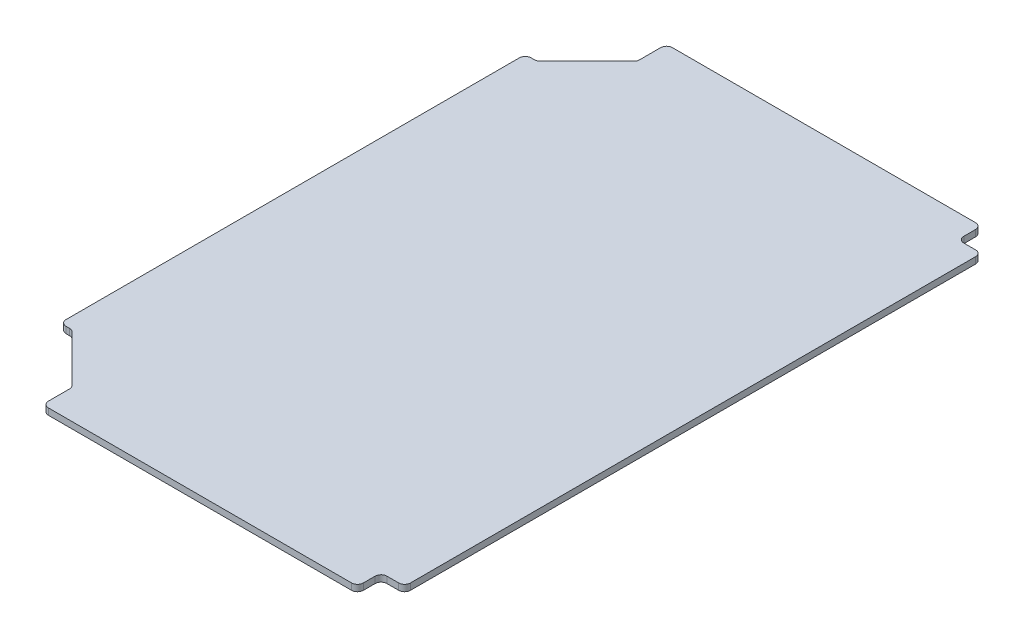
ISO-10303-21;
HEADER;
FILE_DESCRIPTION(('STEP AP214'),'2;1');
FILE_NAME('part.step','',(''),(''),'','','');
FILE_SCHEMA(('AUTOMOTIVE_DESIGN { 1 0 10303 214 1 1 1 1 }'));
ENDSEC;
DATA;
#1=APPLICATION_CONTEXT('core data for automotive mechanical design processes');
#2=APPLICATION_PROTOCOL_DEFINITION('international standard','automotive_design',2000,#1);
#3=PRODUCT_CONTEXT('',#1,'mechanical');
#4=PRODUCT('Part','Part','',(#3));
#5=PRODUCT_RELATED_PRODUCT_CATEGORY('part','',(#4));
#6=PRODUCT_DEFINITION_FORMATION('','',#4);
#7=PRODUCT_DEFINITION_CONTEXT('part definition',#1,'design');
#8=PRODUCT_DEFINITION('design','',#6,#7);
#9=PRODUCT_DEFINITION_SHAPE('','',#8);
#10=(LENGTH_UNIT() NAMED_UNIT(*) SI_UNIT(.MILLI.,.METRE.));
#11=(NAMED_UNIT(*) PLANE_ANGLE_UNIT() SI_UNIT($,.RADIAN.));
#12=(NAMED_UNIT(*) SI_UNIT($,.STERADIAN.) SOLID_ANGLE_UNIT());
#13=UNCERTAINTY_MEASURE_WITH_UNIT(LENGTH_MEASURE(1.E-05),#10,'distance_accuracy_value','');
#14=(GEOMETRIC_REPRESENTATION_CONTEXT(3) GLOBAL_UNCERTAINTY_ASSIGNED_CONTEXT((#13)) GLOBAL_UNIT_ASSIGNED_CONTEXT((#10,
#11,#12)) REPRESENTATION_CONTEXT('',''));
#15=CARTESIAN_POINT('',(0.,0.,0.));
#16=DIRECTION('',(0.,0.,1.));
#17=DIRECTION('',(1.,0.,0.));
#18=AXIS2_PLACEMENT_3D('',#15,#16,#17);
#19=CARTESIAN_POINT('',(190.5,2.778125,0.));
#20=DIRECTION('',(-1.,0.,0.));
#21=DIRECTION('',(0.,0.,1.));
#22=AXIS2_PLACEMENT_3D('',#19,#20,#21);
#23=PLANE('',#22);
#24=DIRECTION('',(0.,0.,-1.));
#25=VECTOR('',#24,1.);
#26=CARTESIAN_POINT('',(190.5,2.778125,0.));
#27=LINE('',#26,#25);
#28=CARTESIAN_POINT('',(190.5,2.778125,-30.48));
#29=VERTEX_POINT('',#28);
#30=CARTESIAN_POINT('',(190.5,2.778125,-274.32));
#31=VERTEX_POINT('',#30);
#32=EDGE_CURVE('E250',#29,#31,#27,.T.);
#33=ORIENTED_EDGE('',*,*,#32,.F.);
#34=DIRECTION('',(0.,1.,0.));
#35=VECTOR('',#34,1.);
#36=CARTESIAN_POINT('',(190.5,2.778125,-30.48));
#37=LINE('',#36,#35);
#38=CARTESIAN_POINT('',(190.5,0.,-30.48));
#39=VERTEX_POINT('',#38);
#40=EDGE_CURVE('E290',#29,#39,#37,.F.);
#41=ORIENTED_EDGE('',*,*,#40,.T.);
#42=DIRECTION('',(0.,0.,-1.));
#43=VECTOR('',#42,1.);
#44=CARTESIAN_POINT('',(190.5,0.,0.));
#45=LINE('',#44,#43);
#46=CARTESIAN_POINT('',(190.5,0.,-274.32));
#47=VERTEX_POINT('',#46);
#48=EDGE_CURVE('E241',#39,#47,#45,.T.);
#49=ORIENTED_EDGE('',*,*,#48,.T.);
#50=DIRECTION('',(0.,1.,0.));
#51=VECTOR('',#50,1.);
#52=CARTESIAN_POINT('',(190.5,2.778125,-274.32));
#53=LINE('',#52,#51);
#54=EDGE_CURVE('E287',#47,#31,#53,.T.);
#55=ORIENTED_EDGE('',*,*,#54,.T.);
#56=EDGE_LOOP('',(#33,#41,#49,#55));
#57=FACE_BOUND('',#56,.T.);
#58=ADVANCED_FACE('F34',(#57),#23,.F.);
#59=CARTESIAN_POINT('',(0.,2.778125,0.));
#60=DIRECTION('',(0.,-1.,0.));
#61=DIRECTION('',(0.,0.,-1.));
#62=AXIS2_PLACEMENT_3D('',#59,#60,#61);
#63=PLANE('',#62);
#64=DIRECTION('',(-1.,0.,0.));
#65=VECTOR('',#64,1.);
#66=CARTESIAN_POINT('',(0.,2.778125,-17.78));
#67=LINE('',#66,#65);
#68=CARTESIAN_POINT('',(177.8,2.778125,-17.78));
#69=VERTEX_POINT('',#68);
#70=CARTESIAN_POINT('',(46.99,2.778125,-17.78));
#71=VERTEX_POINT('',#70);
#72=EDGE_CURVE('E242',#69,#71,#67,.T.);
#73=ORIENTED_EDGE('',*,*,#72,.F.);
#74=CARTESIAN_POINT('',(177.8,2.778125,-20.32));
#75=DIRECTION('',(0.,-1.,0.));
#76=DIRECTION('',(0.,0.,-1.));
#77=AXIS2_PLACEMENT_3D('',#74,#75,#76);
#78=CIRCLE('',#77,2.54);
#79=CARTESIAN_POINT('',(180.34,2.778125,-20.32));
#80=VERTEX_POINT('',#79);
#81=EDGE_CURVE('E245',#69,#80,#78,.F.);
#82=ORIENTED_EDGE('',*,*,#81,.T.);
#83=DIRECTION('',(0.,0.,1.));
#84=VECTOR('',#83,1.);
#85=CARTESIAN_POINT('',(180.34,2.778125,-17.78));
#86=LINE('',#85,#84);
#87=CARTESIAN_POINT('',(180.34,2.778125,-25.4));
#88=VERTEX_POINT('',#87);
#89=EDGE_CURVE('E393',#88,#80,#86,.T.);
#90=ORIENTED_EDGE('',*,*,#89,.F.);
#91=CARTESIAN_POINT('',(182.88,2.778125,-25.4));
#92=DIRECTION('',(0.,-1.,0.));
#93=DIRECTION('',(0.,0.,-1.));
#94=AXIS2_PLACEMENT_3D('',#91,#92,#93);
#95=CIRCLE('',#94,2.54);
#96=CARTESIAN_POINT('',(182.88,2.778125,-27.94));
#97=VERTEX_POINT('',#96);
#98=EDGE_CURVE('E341',#88,#97,#95,.T.);
#99=ORIENTED_EDGE('',*,*,#98,.T.);
#100=DIRECTION('',(-1.,0.,0.));
#101=VECTOR('',#100,1.);
#102=CARTESIAN_POINT('',(190.5,2.778125,-27.94));
#103=LINE('',#102,#101);
#104=CARTESIAN_POINT('',(187.96,2.778125,-27.94));
#105=VERTEX_POINT('',#104);
#106=EDGE_CURVE('E461',#105,#97,#103,.T.);
#107=ORIENTED_EDGE('',*,*,#106,.F.);
#108=CARTESIAN_POINT('',(187.96,2.778125,-30.48));
#109=DIRECTION('',(0.,-1.,0.));
#110=DIRECTION('',(0.,0.,-1.));
#111=AXIS2_PLACEMENT_3D('',#108,#109,#110);
#112=CIRCLE('',#111,2.54);
#113=EDGE_CURVE('E263',#105,#29,#112,.F.);
#114=ORIENTED_EDGE('',*,*,#113,.T.);
#115=ORIENTED_EDGE('',*,*,#32,.T.);
#116=CARTESIAN_POINT('',(187.96,2.778125,-274.32));
#117=DIRECTION('',(0.,-1.,0.));
#118=DIRECTION('',(0.,0.,-1.));
#119=AXIS2_PLACEMENT_3D('',#116,#117,#118);
#120=CIRCLE('',#119,2.54);
#121=CARTESIAN_POINT('',(187.96,2.778125,-276.86));
#122=VERTEX_POINT('',#121);
#123=EDGE_CURVE('E261',#31,#122,#120,.F.);
#124=ORIENTED_EDGE('',*,*,#123,.T.);
#125=DIRECTION('',(1.,0.,0.));
#126=VECTOR('',#125,1.);
#127=CARTESIAN_POINT('',(190.5,2.778125,-276.86));
#128=LINE('',#127,#126);
#129=CARTESIAN_POINT('',(182.88,2.778125,-276.86));
#130=VERTEX_POINT('',#129);
#131=EDGE_CURVE('E445',#130,#122,#128,.T.);
#132=ORIENTED_EDGE('',*,*,#131,.F.);
#133=CARTESIAN_POINT('',(182.88,2.778125,-279.4));
#134=DIRECTION('',(0.,-1.,0.));
#135=DIRECTION('',(0.,0.,-1.));
#136=AXIS2_PLACEMENT_3D('',#133,#134,#135);
#137=CIRCLE('',#136,2.54);
#138=CARTESIAN_POINT('',(180.34,2.778125,-279.4));
#139=VERTEX_POINT('',#138);
#140=EDGE_CURVE('E345',#130,#139,#137,.T.);
#141=ORIENTED_EDGE('',*,*,#140,.T.);
#142=DIRECTION('',(0.,0.,1.));
#143=VECTOR('',#142,1.);
#144=CARTESIAN_POINT('',(180.34,2.778125,-287.02));
#145=LINE('',#144,#143);
#146=CARTESIAN_POINT('',(180.34,2.778125,-284.48));
#147=VERTEX_POINT('',#146);
#148=EDGE_CURVE('E452',#147,#139,#145,.T.);
#149=ORIENTED_EDGE('',*,*,#148,.F.);
#150=CARTESIAN_POINT('',(177.8,2.778125,-284.48));
#151=DIRECTION('',(0.,-1.,0.));
#152=DIRECTION('',(0.,0.,-1.));
#153=AXIS2_PLACEMENT_3D('',#150,#151,#152);
#154=CIRCLE('',#153,2.54);
#155=CARTESIAN_POINT('',(177.8,2.778125,-287.02));
#156=VERTEX_POINT('',#155);
#157=EDGE_CURVE('E255',#147,#156,#154,.F.);
#158=ORIENTED_EDGE('',*,*,#157,.T.);
#159=DIRECTION('',(1.,0.,0.));
#160=VECTOR('',#159,1.);
#161=CARTESIAN_POINT('',(0.,2.778125,-287.02));
#162=LINE('',#161,#160);
#163=CARTESIAN_POINT('',(46.9900000000001,2.778125,-287.02));
#164=VERTEX_POINT('',#163);
#165=EDGE_CURVE('E423',#164,#156,#162,.T.);
#166=ORIENTED_EDGE('',*,*,#165,.F.);
#167=CARTESIAN_POINT('',(46.9900000000001,2.778125,-284.48));
#168=DIRECTION('',(0.,-1.,0.));
#169=DIRECTION('',(0.,0.,-1.));
#170=AXIS2_PLACEMENT_3D('',#167,#168,#169);
#171=CIRCLE('',#170,2.54);
#172=CARTESIAN_POINT('',(44.4500000000001,2.778125,-284.48));
#173=VERTEX_POINT('',#172);
#174=EDGE_CURVE('E246',#164,#173,#171,.F.);
#175=ORIENTED_EDGE('',*,*,#174,.T.);
#176=DIRECTION('',(0.,0.,-1.));
#177=VECTOR('',#176,1.);
#178=CARTESIAN_POINT('',(44.45,2.778125,-274.32));
#179=LINE('',#178,#177);
#180=CARTESIAN_POINT('',(44.45,2.778125,-275.372102448428));
#181=VERTEX_POINT('',#180);
#182=EDGE_CURVE('E367',#181,#173,#179,.T.);
#183=ORIENTED_EDGE('',*,*,#182,.F.);
#184=CARTESIAN_POINT('',(41.91,2.778125,-275.372102448428));
#185=DIRECTION('',(0.,-1.,0.));
#186=DIRECTION('',(0.,0.,-1.));
#187=AXIS2_PLACEMENT_3D('',#184,#185,#186);
#188=CIRCLE('',#187,2.54);
#189=CARTESIAN_POINT('',(43.7060512242139,2.778125,-273.576051224214));
#190=VERTEX_POINT('',#189);
#191=EDGE_CURVE('E42',#181,#190,#188,.T.);
#192=ORIENTED_EDGE('',*,*,#191,.T.);
#193=DIRECTION('',(0.707106781186547,0.,-0.707106781186548));
#194=VECTOR('',#193,1.);
#195=CARTESIAN_POINT('',(22.86,2.778125,-252.73));
#196=LINE('',#195,#194);
#197=CARTESIAN_POINT('',(23.6039487757862,2.778125,-253.473948775786));
#198=VERTEX_POINT('',#197);
#199=EDGE_CURVE('E365',#198,#190,#196,.T.);
#200=ORIENTED_EDGE('',*,*,#199,.F.);
#201=CARTESIAN_POINT('',(21.8078975515723,2.778125,-255.27));
#202=DIRECTION('',(0.,-1.,0.));
#203=DIRECTION('',(0.,0.,-1.));
#204=AXIS2_PLACEMENT_3D('',#201,#202,#203);
#205=CIRCLE('',#204,2.54);
#206=CARTESIAN_POINT('',(21.8078975515723,2.778125,-252.73));
#207=VERTEX_POINT('',#206);
#208=EDGE_CURVE('E353',#198,#207,#205,.T.);
#209=ORIENTED_EDGE('',*,*,#208,.T.);
#210=DIRECTION('',(1.,0.,0.));
#211=VECTOR('',#210,1.);
#212=CARTESIAN_POINT('',(22.86,2.778125,-252.73));
#213=LINE('',#212,#211);
#214=CARTESIAN_POINT('',(20.32,2.778125,-252.73));
#215=VERTEX_POINT('',#214);
#216=EDGE_CURVE('E377',#215,#207,#213,.T.);
#217=ORIENTED_EDGE('',*,*,#216,.F.);
#218=CARTESIAN_POINT('',(20.32,2.778125,-250.19));
#219=DIRECTION('',(0.,-1.,0.));
#220=DIRECTION('',(0.,0.,-1.));
#221=AXIS2_PLACEMENT_3D('',#218,#219,#220);
#222=CIRCLE('',#221,2.54);
#223=CARTESIAN_POINT('',(17.78,2.778125,-250.19));
#224=VERTEX_POINT('',#223);
#225=EDGE_CURVE('E257',#215,#224,#222,.F.);
#226=ORIENTED_EDGE('',*,*,#225,.T.);
#227=DIRECTION('',(0.,0.,-1.));
#228=VECTOR('',#227,1.);
#229=CARTESIAN_POINT('',(17.78,2.778125,-287.02));
#230=LINE('',#229,#228);
#231=CARTESIAN_POINT('',(17.78,2.778125,-54.61));
#232=VERTEX_POINT('',#231);
#233=EDGE_CURVE('E397',#232,#224,#230,.T.);
#234=ORIENTED_EDGE('',*,*,#233,.F.);
#235=CARTESIAN_POINT('',(20.32,2.778125,-54.61));
#236=DIRECTION('',(0.,-1.,0.));
#237=DIRECTION('',(0.,0.,-1.));
#238=AXIS2_PLACEMENT_3D('',#235,#236,#237);
#239=CIRCLE('',#238,2.54);
#240=CARTESIAN_POINT('',(20.32,2.778125,-52.07));
#241=VERTEX_POINT('',#240);
#242=EDGE_CURVE('E259',#232,#241,#239,.F.);
#243=ORIENTED_EDGE('',*,*,#242,.T.);
#244=DIRECTION('',(-1.,0.,0.));
#245=VECTOR('',#244,1.);
#246=CARTESIAN_POINT('',(22.8600000000001,2.778125,-52.07));
#247=LINE('',#246,#245);
#248=CARTESIAN_POINT('',(21.8078975515724,2.778125,-52.07));
#249=VERTEX_POINT('',#248);
#250=EDGE_CURVE('E406',#249,#241,#247,.T.);
#251=ORIENTED_EDGE('',*,*,#250,.F.);
#252=CARTESIAN_POINT('',(21.8078975515724,2.778125,-49.53));
#253=DIRECTION('',(0.,-1.,0.));
#254=DIRECTION('',(0.,0.,-1.));
#255=AXIS2_PLACEMENT_3D('',#252,#253,#254);
#256=CIRCLE('',#255,2.54);
#257=CARTESIAN_POINT('',(23.6039487757863,2.778125,-51.3260512242138));
#258=VERTEX_POINT('',#257);
#259=EDGE_CURVE('E349',#249,#258,#256,.T.);
#260=ORIENTED_EDGE('',*,*,#259,.T.);
#261=DIRECTION('',(-0.707106781186548,0.,-0.707106781186547));
#262=VECTOR('',#261,1.);
#263=CARTESIAN_POINT('',(22.8600000000001,2.778125,-52.07));
#264=LINE('',#263,#262);
#265=CARTESIAN_POINT('',(43.7060512242139,2.778125,-31.2239487757863));
#266=VERTEX_POINT('',#265);
#267=EDGE_CURVE('E414',#266,#258,#264,.T.);
#268=ORIENTED_EDGE('',*,*,#267,.F.);
#269=CARTESIAN_POINT('',(41.91,2.778125,-29.4278975515724));
#270=DIRECTION('',(0.,-1.,0.));
#271=DIRECTION('',(0.,0.,-1.));
#272=AXIS2_PLACEMENT_3D('',#269,#270,#271);
#273=CIRCLE('',#272,2.54);
#274=CARTESIAN_POINT('',(44.45,2.778125,-29.4278975515724));
#275=VERTEX_POINT('',#274);
#276=EDGE_CURVE('E357',#266,#275,#273,.T.);
#277=ORIENTED_EDGE('',*,*,#276,.T.);
#278=DIRECTION('',(0.,0.,-1.));
#279=VECTOR('',#278,1.);
#280=CARTESIAN_POINT('',(44.45,2.778125,-30.4800000000001));
#281=LINE('',#280,#279);
#282=CARTESIAN_POINT('',(44.45,2.778125,-20.32));
#283=VERTEX_POINT('',#282);
#284=EDGE_CURVE('E411',#283,#275,#281,.T.);
#285=ORIENTED_EDGE('',*,*,#284,.F.);
#286=CARTESIAN_POINT('',(46.99,2.778125,-20.32));
#287=DIRECTION('',(0.,-1.,0.));
#288=DIRECTION('',(0.,0.,-1.));
#289=AXIS2_PLACEMENT_3D('',#286,#287,#288);
#290=CIRCLE('',#289,2.54);
#291=EDGE_CURVE('E248',#283,#71,#290,.F.);
#292=ORIENTED_EDGE('',*,*,#291,.T.);
#293=EDGE_LOOP('',(#73,#82,#90,#99,#107,#114,#115,#124,#132,#141,#149,#158,#166,#175,#183,#192,
#200,#209,#217,#226,#234,#243,#251,#260,#268,#277,#285,#292));
#294=FACE_BOUND('',#293,.T.);
#295=ADVANCED_FACE('F364',(#294),#63,.F.);
#296=CARTESIAN_POINT('',(0.,0.,0.));
#297=DIRECTION('',(0.,-1.,0.));
#298=DIRECTION('',(0.,0.,-1.));
#299=AXIS2_PLACEMENT_3D('',#296,#297,#298);
#300=PLANE('',#299);
#301=DIRECTION('',(0.,0.,1.));
#302=VECTOR('',#301,1.);
#303=CARTESIAN_POINT('',(180.34,0.,-17.78));
#304=LINE('',#303,#302);
#305=CARTESIAN_POINT('',(180.34,0.,-25.4));
#306=VERTEX_POINT('',#305);
#307=CARTESIAN_POINT('',(180.34,0.,-20.32));
#308=VERTEX_POINT('',#307);
#309=EDGE_CURVE('E226',#306,#308,#304,.T.);
#310=ORIENTED_EDGE('',*,*,#309,.T.);
#311=CARTESIAN_POINT('',(177.8,0.,-20.32));
#312=DIRECTION('',(0.,-1.,0.));
#313=DIRECTION('',(0.,0.,-1.));
#314=AXIS2_PLACEMENT_3D('',#311,#312,#313);
#315=CIRCLE('',#314,2.54);
#316=CARTESIAN_POINT('',(177.8,0.,-17.78));
#317=VERTEX_POINT('',#316);
#318=EDGE_CURVE('E220',#308,#317,#315,.T.);
#319=ORIENTED_EDGE('',*,*,#318,.T.);
#320=DIRECTION('',(-1.,0.,0.));
#321=VECTOR('',#320,1.);
#322=CARTESIAN_POINT('',(0.,0.,-17.78));
#323=LINE('',#322,#321);
#324=CARTESIAN_POINT('',(46.99,0.,-17.78));
#325=VERTEX_POINT('',#324);
#326=EDGE_CURVE('E223',#317,#325,#323,.T.);
#327=ORIENTED_EDGE('',*,*,#326,.T.);
#328=CARTESIAN_POINT('',(46.99,0.,-20.32));
#329=DIRECTION('',(0.,-1.,0.));
#330=DIRECTION('',(0.,0.,-1.));
#331=AXIS2_PLACEMENT_3D('',#328,#329,#330);
#332=CIRCLE('',#331,2.54);
#333=CARTESIAN_POINT('',(44.45,0.,-20.32));
#334=VERTEX_POINT('',#333);
#335=EDGE_CURVE('E273',#325,#334,#332,.T.);
#336=ORIENTED_EDGE('',*,*,#335,.T.);
#337=DIRECTION('',(0.,0.,-1.));
#338=VECTOR('',#337,1.);
#339=CARTESIAN_POINT('',(44.45,0.,-30.4800000000001));
#340=LINE('',#339,#338);
#341=CARTESIAN_POINT('',(44.45,0.,-29.4278975515724));
#342=VERTEX_POINT('',#341);
#343=EDGE_CURVE('E402',#334,#342,#340,.T.);
#344=ORIENTED_EDGE('',*,*,#343,.T.);
#345=CARTESIAN_POINT('',(41.91,0.,-29.4278975515724));
#346=DIRECTION('',(0.,-1.,0.));
#347=DIRECTION('',(0.,0.,-1.));
#348=AXIS2_PLACEMENT_3D('',#345,#346,#347);
#349=CIRCLE('',#348,2.54);
#350=CARTESIAN_POINT('',(43.7060512242139,0.,-31.2239487757863));
#351=VERTEX_POINT('',#350);
#352=EDGE_CURVE('E359',#342,#351,#349,.F.);
#353=ORIENTED_EDGE('',*,*,#352,.T.);
#354=DIRECTION('',(-0.707106781186548,0.,-0.707106781186547));
#355=VECTOR('',#354,1.);
#356=CARTESIAN_POINT('',(22.8600000000001,0.,-52.07));
#357=LINE('',#356,#355);
#358=CARTESIAN_POINT('',(23.6039487757863,0.,-51.3260512242138));
#359=VERTEX_POINT('',#358);
#360=EDGE_CURVE('E405',#351,#359,#357,.T.);
#361=ORIENTED_EDGE('',*,*,#360,.T.);
#362=CARTESIAN_POINT('',(21.8078975515724,0.,-49.53));
#363=DIRECTION('',(0.,-1.,0.));
#364=DIRECTION('',(0.,0.,-1.));
#365=AXIS2_PLACEMENT_3D('',#362,#363,#364);
#366=CIRCLE('',#365,2.54);
#367=CARTESIAN_POINT('',(21.8078975515724,0.,-52.07));
#368=VERTEX_POINT('',#367);
#369=EDGE_CURVE('E351',#359,#368,#366,.F.);
#370=ORIENTED_EDGE('',*,*,#369,.T.);
#371=DIRECTION('',(-1.,0.,0.));
#372=VECTOR('',#371,1.);
#373=CARTESIAN_POINT('',(22.8600000000001,0.,-52.07));
#374=LINE('',#373,#372);
#375=CARTESIAN_POINT('',(20.32,0.,-52.07));
#376=VERTEX_POINT('',#375);
#377=EDGE_CURVE('E399',#368,#376,#374,.T.);
#378=ORIENTED_EDGE('',*,*,#377,.T.);
#379=CARTESIAN_POINT('',(20.32,0.,-54.61));
#380=DIRECTION('',(0.,-1.,0.));
#381=DIRECTION('',(0.,0.,-1.));
#382=AXIS2_PLACEMENT_3D('',#379,#380,#381);
#383=CIRCLE('',#382,2.54);
#384=CARTESIAN_POINT('',(17.78,0.,-54.61));
#385=VERTEX_POINT('',#384);
#386=EDGE_CURVE('E278',#376,#385,#383,.T.);
#387=ORIENTED_EDGE('',*,*,#386,.T.);
#388=DIRECTION('',(0.,0.,-1.));
#389=VECTOR('',#388,1.);
#390=CARTESIAN_POINT('',(17.78,0.,-287.02));
#391=LINE('',#390,#389);
#392=CARTESIAN_POINT('',(17.78,0.,-250.19));
#393=VERTEX_POINT('',#392);
#394=EDGE_CURVE('E420',#385,#393,#391,.T.);
#395=ORIENTED_EDGE('',*,*,#394,.T.);
#396=CARTESIAN_POINT('',(20.32,0.,-250.19));
#397=DIRECTION('',(0.,-1.,0.));
#398=DIRECTION('',(0.,0.,-1.));
#399=AXIS2_PLACEMENT_3D('',#396,#397,#398);
#400=CIRCLE('',#399,2.54);
#401=CARTESIAN_POINT('',(20.32,0.,-252.73));
#402=VERTEX_POINT('',#401);
#403=EDGE_CURVE('E276',#393,#402,#400,.T.);
#404=ORIENTED_EDGE('',*,*,#403,.T.);
#405=DIRECTION('',(1.,0.,0.));
#406=VECTOR('',#405,1.);
#407=CARTESIAN_POINT('',(22.86,0.,-252.73));
#408=LINE('',#407,#406);
#409=CARTESIAN_POINT('',(21.8078975515723,0.,-252.73));
#410=VERTEX_POINT('',#409);
#411=EDGE_CURVE('E388',#402,#410,#408,.T.);
#412=ORIENTED_EDGE('',*,*,#411,.T.);
#413=CARTESIAN_POINT('',(21.8078975515723,0.,-255.27));
#414=DIRECTION('',(0.,-1.,0.));
#415=DIRECTION('',(0.,0.,-1.));
#416=AXIS2_PLACEMENT_3D('',#413,#414,#415);
#417=CIRCLE('',#416,2.54);
#418=CARTESIAN_POINT('',(23.6039487757862,0.,-253.473948775786));
#419=VERTEX_POINT('',#418);
#420=EDGE_CURVE('E355',#410,#419,#417,.F.);
#421=ORIENTED_EDGE('',*,*,#420,.T.);
#422=DIRECTION('',(0.707106781186547,0.,-0.707106781186548));
#423=VECTOR('',#422,1.);
#424=CARTESIAN_POINT('',(22.86,0.,-252.73));
#425=LINE('',#424,#423);
#426=CARTESIAN_POINT('',(43.7060512242139,0.,-273.576051224214));
#427=VERTEX_POINT('',#426);
#428=EDGE_CURVE('E384',#419,#427,#425,.T.);
#429=ORIENTED_EDGE('',*,*,#428,.T.);
#430=CARTESIAN_POINT('',(41.91,0.,-275.372102448428));
#431=DIRECTION('',(0.,-1.,0.));
#432=DIRECTION('',(0.,0.,-1.));
#433=AXIS2_PLACEMENT_3D('',#430,#431,#432);
#434=CIRCLE('',#433,2.54);
#435=CARTESIAN_POINT('',(44.45,0.,-275.372102448428));
#436=VERTEX_POINT('',#435);
#437=EDGE_CURVE('E11',#427,#436,#434,.F.);
#438=ORIENTED_EDGE('',*,*,#437,.T.);
#439=DIRECTION('',(0.,0.,-1.));
#440=VECTOR('',#439,1.);
#441=CARTESIAN_POINT('',(44.45,0.,-274.32));
#442=LINE('',#441,#440);
#443=CARTESIAN_POINT('',(44.4500000000001,0.,-284.48));
#444=VERTEX_POINT('',#443);
#445=EDGE_CURVE('E376',#436,#444,#442,.T.);
#446=ORIENTED_EDGE('',*,*,#445,.T.);
#447=CARTESIAN_POINT('',(46.9900000000001,0.,-284.48));
#448=DIRECTION('',(0.,-1.,0.));
#449=DIRECTION('',(0.,0.,-1.));
#450=AXIS2_PLACEMENT_3D('',#447,#448,#449);
#451=CIRCLE('',#450,2.54);
#452=CARTESIAN_POINT('',(46.9900000000001,0.,-287.02));
#453=VERTEX_POINT('',#452);
#454=EDGE_CURVE('E271',#444,#453,#451,.T.);
#455=ORIENTED_EDGE('',*,*,#454,.T.);
#456=DIRECTION('',(1.,0.,0.));
#457=VECTOR('',#456,1.);
#458=CARTESIAN_POINT('',(0.,0.,-287.02));
#459=LINE('',#458,#457);
#460=CARTESIAN_POINT('',(177.8,0.,-287.02));
#461=VERTEX_POINT('',#460);
#462=EDGE_CURVE('E427',#453,#461,#459,.T.);
#463=ORIENTED_EDGE('',*,*,#462,.T.);
#464=CARTESIAN_POINT('',(177.8,0.,-284.48));
#465=DIRECTION('',(0.,-1.,0.));
#466=DIRECTION('',(0.,0.,-1.));
#467=AXIS2_PLACEMENT_3D('',#464,#465,#466);
#468=CIRCLE('',#467,2.54);
#469=CARTESIAN_POINT('',(180.34,0.,-284.48));
#470=VERTEX_POINT('',#469);
#471=EDGE_CURVE('E56',#461,#470,#468,.T.);
#472=ORIENTED_EDGE('',*,*,#471,.T.);
#473=DIRECTION('',(0.,0.,1.));
#474=VECTOR('',#473,1.);
#475=CARTESIAN_POINT('',(180.34,0.,-287.02));
#476=LINE('',#475,#474);
#477=CARTESIAN_POINT('',(180.34,0.,-279.4));
#478=VERTEX_POINT('',#477);
#479=EDGE_CURVE('E451',#470,#478,#476,.T.);
#480=ORIENTED_EDGE('',*,*,#479,.T.);
#481=CARTESIAN_POINT('',(182.88,0.,-279.4));
#482=DIRECTION('',(0.,-1.,0.));
#483=DIRECTION('',(0.,0.,-1.));
#484=AXIS2_PLACEMENT_3D('',#481,#482,#483);
#485=CIRCLE('',#484,2.54);
#486=CARTESIAN_POINT('',(182.88,0.,-276.86));
#487=VERTEX_POINT('',#486);
#488=EDGE_CURVE('E347',#478,#487,#485,.F.);
#489=ORIENTED_EDGE('',*,*,#488,.T.);
#490=DIRECTION('',(1.,0.,0.));
#491=VECTOR('',#490,1.);
#492=CARTESIAN_POINT('',(190.5,0.,-276.86));
#493=LINE('',#492,#491);
#494=CARTESIAN_POINT('',(187.96,0.,-276.86));
#495=VERTEX_POINT('',#494);
#496=EDGE_CURVE('E415',#487,#495,#493,.T.);
#497=ORIENTED_EDGE('',*,*,#496,.T.);
#498=CARTESIAN_POINT('',(187.96,0.,-274.32));
#499=DIRECTION('',(0.,-1.,0.));
#500=DIRECTION('',(0.,0.,-1.));
#501=AXIS2_PLACEMENT_3D('',#498,#499,#500);
#502=CIRCLE('',#501,2.54);
#503=EDGE_CURVE('E280',#495,#47,#502,.T.);
#504=ORIENTED_EDGE('',*,*,#503,.T.);
#505=ORIENTED_EDGE('',*,*,#48,.F.);
#506=CARTESIAN_POINT('',(187.96,0.,-30.48));
#507=DIRECTION('',(0.,-1.,0.));
#508=DIRECTION('',(0.,0.,-1.));
#509=AXIS2_PLACEMENT_3D('',#506,#507,#508);
#510=CIRCLE('',#509,2.54);
#511=CARTESIAN_POINT('',(187.96,0.,-27.94));
#512=VERTEX_POINT('',#511);
#513=EDGE_CURVE('E231',#39,#512,#510,.T.);
#514=ORIENTED_EDGE('',*,*,#513,.T.);
#515=DIRECTION('',(-1.,0.,0.));
#516=VECTOR('',#515,1.);
#517=CARTESIAN_POINT('',(190.5,0.,-27.94));
#518=LINE('',#517,#516);
#519=CARTESIAN_POINT('',(182.88,0.,-27.94));
#520=VERTEX_POINT('',#519);
#521=EDGE_CURVE('E458',#512,#520,#518,.T.);
#522=ORIENTED_EDGE('',*,*,#521,.T.);
#523=CARTESIAN_POINT('',(182.88,0.,-25.4));
#524=DIRECTION('',(0.,-1.,0.));
#525=DIRECTION('',(0.,0.,-1.));
#526=AXIS2_PLACEMENT_3D('',#523,#524,#525);
#527=CIRCLE('',#526,2.54);
#528=EDGE_CURVE('E343',#520,#306,#527,.F.);
#529=ORIENTED_EDGE('',*,*,#528,.T.);
#530=EDGE_LOOP('',(#310,#319,#327,#336,#344,#353,#361,#370,#378,#387,#395,#404,#412,#421,#429,
#438,#446,#455,#463,#472,#480,#489,#497,#504,#505,#514,#522,#529));
#531=FACE_BOUND('',#530,.T.);
#532=ADVANCED_FACE('F222',(#531),#300,.T.);
#533=CARTESIAN_POINT('',(0.,0.,-287.02));
#534=DIRECTION('',(0.,0.,1.));
#535=DIRECTION('',(1.,0.,0.));
#536=AXIS2_PLACEMENT_3D('',#533,#534,#535);
#537=PLANE('',#536);
#538=ORIENTED_EDGE('',*,*,#165,.T.);
#539=DIRECTION('',(0.,1.,0.));
#540=VECTOR('',#539,1.);
#541=CARTESIAN_POINT('',(177.8,0.,-287.02));
#542=LINE('',#541,#540);
#543=EDGE_CURVE('E329',#156,#461,#542,.F.);
#544=ORIENTED_EDGE('',*,*,#543,.T.);
#545=ORIENTED_EDGE('',*,*,#462,.F.);
#546=DIRECTION('',(0.,1.,0.));
#547=VECTOR('',#546,1.);
#548=CARTESIAN_POINT('',(46.9900000000001,0.,-287.02));
#549=LINE('',#548,#547);
#550=EDGE_CURVE('E326',#453,#164,#549,.T.);
#551=ORIENTED_EDGE('',*,*,#550,.T.);
#552=EDGE_LOOP('',(#538,#544,#545,#551));
#553=FACE_BOUND('',#552,.T.);
#554=ADVANCED_FACE('F612',(#553),#537,.F.);
#555=CARTESIAN_POINT('',(0.,0.,-17.78));
#556=DIRECTION('',(0.,0.,-1.));
#557=DIRECTION('',(-1.,0.,0.));
#558=AXIS2_PLACEMENT_3D('',#555,#556,#557);
#559=PLANE('',#558);
#560=ORIENTED_EDGE('',*,*,#326,.F.);
#561=DIRECTION('',(0.,1.,0.));
#562=VECTOR('',#561,1.);
#563=CARTESIAN_POINT('',(177.8,0.,-17.78));
#564=LINE('',#563,#562);
#565=EDGE_CURVE('E237',#317,#69,#564,.T.);
#566=ORIENTED_EDGE('',*,*,#565,.T.);
#567=ORIENTED_EDGE('',*,*,#72,.T.);
#568=DIRECTION('',(0.,1.,0.));
#569=VECTOR('',#568,1.);
#570=CARTESIAN_POINT('',(46.99,0.,-17.78));
#571=LINE('',#570,#569);
#572=EDGE_CURVE('E240',#71,#325,#571,.F.);
#573=ORIENTED_EDGE('',*,*,#572,.T.);
#574=EDGE_LOOP('',(#560,#566,#567,#573));
#575=FACE_BOUND('',#574,.T.);
#576=ADVANCED_FACE('F235',(#575),#559,.F.);
#577=CARTESIAN_POINT('',(17.78,0.,-287.02));
#578=DIRECTION('',(1.,0.,0.));
#579=DIRECTION('',(0.,0.,-1.));
#580=AXIS2_PLACEMENT_3D('',#577,#578,#579);
#581=PLANE('',#580);
#582=ORIENTED_EDGE('',*,*,#394,.F.);
#583=DIRECTION('',(0.,1.,0.));
#584=VECTOR('',#583,1.);
#585=CARTESIAN_POINT('',(17.78,0.,-54.61));
#586=LINE('',#585,#584);
#587=EDGE_CURVE('E303',#385,#232,#586,.T.);
#588=ORIENTED_EDGE('',*,*,#587,.T.);
#589=ORIENTED_EDGE('',*,*,#233,.T.);
#590=DIRECTION('',(0.,1.,0.));
#591=VECTOR('',#590,1.);
#592=CARTESIAN_POINT('',(17.78,0.,-250.19));
#593=LINE('',#592,#591);
#594=EDGE_CURVE('E301',#224,#393,#593,.F.);
#595=ORIENTED_EDGE('',*,*,#594,.T.);
#596=EDGE_LOOP('',(#582,#588,#589,#595));
#597=FACE_BOUND('',#596,.T.);
#598=ADVANCED_FACE('F504',(#597),#581,.F.);
#599=CARTESIAN_POINT('',(22.8600000000001,0.,-52.07));
#600=DIRECTION('',(0.,0.,-1.));
#601=DIRECTION('',(-1.,0.,0.));
#602=AXIS2_PLACEMENT_3D('',#599,#600,#601);
#603=PLANE('',#602);
#604=ORIENTED_EDGE('',*,*,#250,.T.);
#605=DIRECTION('',(0.,1.,0.));
#606=VECTOR('',#605,1.);
#607=CARTESIAN_POINT('',(20.32,0.,-52.07));
#608=LINE('',#607,#606);
#609=EDGE_CURVE('E309',#241,#376,#608,.F.);
#610=ORIENTED_EDGE('',*,*,#609,.T.);
#611=ORIENTED_EDGE('',*,*,#377,.F.);
#612=DIRECTION('',(0.,1.,0.));
#613=VECTOR('',#612,1.);
#614=CARTESIAN_POINT('',(21.8078975515724,2.778125,-52.07));
#615=LINE('',#614,#613);
#616=EDGE_CURVE('E306',#368,#249,#615,.T.);
#617=ORIENTED_EDGE('',*,*,#616,.T.);
#618=EDGE_LOOP('',(#604,#610,#611,#617));
#619=FACE_BOUND('',#618,.T.);
#620=ADVANCED_FACE('F495',(#619),#603,.F.);
#621=CARTESIAN_POINT('',(22.8600000000001,0.,-52.07));
#622=DIRECTION('',(0.707106781186547,0.,-0.707106781186548));
#623=DIRECTION('',(-0.707106781186548,0.,-0.707106781186547));
#624=AXIS2_PLACEMENT_3D('',#621,#622,#623);
#625=PLANE('',#624);
#626=ORIENTED_EDGE('',*,*,#267,.T.);
#627=DIRECTION('',(0.,1.,0.));
#628=VECTOR('',#627,1.);
#629=CARTESIAN_POINT('',(23.6039487757863,0.,-51.3260512242138));
#630=LINE('',#629,#628);
#631=EDGE_CURVE('E314',#258,#359,#630,.F.);
#632=ORIENTED_EDGE('',*,*,#631,.T.);
#633=ORIENTED_EDGE('',*,*,#360,.F.);
#634=DIRECTION('',(0.,1.,0.));
#635=VECTOR('',#634,1.);
#636=CARTESIAN_POINT('',(43.7060512242139,2.778125,-31.2239487757863));
#637=LINE('',#636,#635);
#638=EDGE_CURVE('E311',#351,#266,#637,.T.);
#639=ORIENTED_EDGE('',*,*,#638,.T.);
#640=EDGE_LOOP('',(#626,#632,#633,#639));
#641=FACE_BOUND('',#640,.T.);
#642=ADVANCED_FACE('F486',(#641),#625,.F.);
#643=CARTESIAN_POINT('',(44.45,0.,-30.4800000000001));
#644=DIRECTION('',(1.,0.,0.));
#645=DIRECTION('',(0.,0.,-1.));
#646=AXIS2_PLACEMENT_3D('',#643,#644,#645);
#647=PLANE('',#646);
#648=ORIENTED_EDGE('',*,*,#343,.F.);
#649=DIRECTION('',(0.,1.,0.));
#650=VECTOR('',#649,1.);
#651=CARTESIAN_POINT('',(44.45,0.,-20.32));
#652=LINE('',#651,#650);
#653=EDGE_CURVE('E333',#334,#283,#652,.T.);
#654=ORIENTED_EDGE('',*,*,#653,.T.);
#655=ORIENTED_EDGE('',*,*,#284,.T.);
#656=DIRECTION('',(0.,1.,0.));
#657=VECTOR('',#656,1.);
#658=CARTESIAN_POINT('',(44.45,0.,-29.4278975515724));
#659=LINE('',#658,#657);
#660=EDGE_CURVE('E331',#275,#342,#659,.F.);
#661=ORIENTED_EDGE('',*,*,#660,.T.);
#662=EDGE_LOOP('',(#648,#654,#655,#661));
#663=FACE_BOUND('',#662,.T.);
#664=ADVANCED_FACE('F478',(#663),#647,.F.);
#665=CARTESIAN_POINT('',(44.45,0.,-274.32));
#666=DIRECTION('',(1.,0.,0.));
#667=DIRECTION('',(0.,0.,-1.));
#668=AXIS2_PLACEMENT_3D('',#665,#666,#667);
#669=PLANE('',#668);
#670=ORIENTED_EDGE('',*,*,#445,.F.);
#671=DIRECTION('',(0.,1.,0.));
#672=VECTOR('',#671,1.);
#673=CARTESIAN_POINT('',(44.45,2.778125,-275.372102448428));
#674=LINE('',#673,#672);
#675=EDGE_CURVE('E338',#436,#181,#674,.T.);
#676=ORIENTED_EDGE('',*,*,#675,.T.);
#677=ORIENTED_EDGE('',*,*,#182,.T.);
#678=DIRECTION('',(0.,1.,0.));
#679=VECTOR('',#678,1.);
#680=CARTESIAN_POINT('',(44.4500000000001,0.,-284.48));
#681=LINE('',#680,#679);
#682=EDGE_CURVE('E336',#173,#444,#681,.F.);
#683=ORIENTED_EDGE('',*,*,#682,.T.);
#684=EDGE_LOOP('',(#670,#676,#677,#683));
#685=FACE_BOUND('',#684,.T.);
#686=ADVANCED_FACE('F386',(#685),#669,.F.);
#687=CARTESIAN_POINT('',(22.86,0.,-252.73));
#688=DIRECTION('',(0.707106781186548,0.,0.707106781186547));
#689=DIRECTION('',(0.707106781186547,0.,-0.707106781186548));
#690=AXIS2_PLACEMENT_3D('',#687,#688,#689);
#691=PLANE('',#690);
#692=ORIENTED_EDGE('',*,*,#428,.F.);
#693=DIRECTION('',(0.,1.,0.));
#694=VECTOR('',#693,1.);
#695=CARTESIAN_POINT('',(23.6039487757862,2.778125,-253.473948775786));
#696=LINE('',#695,#694);
#697=EDGE_CURVE('E323',#419,#198,#696,.T.);
#698=ORIENTED_EDGE('',*,*,#697,.T.);
#699=ORIENTED_EDGE('',*,*,#199,.T.);
#700=DIRECTION('',(0.,1.,0.));
#701=VECTOR('',#700,1.);
#702=CARTESIAN_POINT('',(43.7060512242139,0.,-273.576051224214));
#703=LINE('',#702,#701);
#704=EDGE_CURVE('E321',#190,#427,#703,.F.);
#705=ORIENTED_EDGE('',*,*,#704,.T.);
#706=EDGE_LOOP('',(#692,#698,#699,#705));
#707=FACE_BOUND('',#706,.T.);
#708=ADVANCED_FACE('F373',(#707),#691,.F.);
#709=CARTESIAN_POINT('',(22.86,0.,-252.73));
#710=DIRECTION('',(0.,0.,1.));
#711=DIRECTION('',(1.,0.,0.));
#712=AXIS2_PLACEMENT_3D('',#709,#710,#711);
#713=PLANE('',#712);
#714=ORIENTED_EDGE('',*,*,#411,.F.);
#715=DIRECTION('',(0.,1.,0.));
#716=VECTOR('',#715,1.);
#717=CARTESIAN_POINT('',(20.32,0.,-252.73));
#718=LINE('',#717,#716);
#719=EDGE_CURVE('E318',#402,#215,#718,.T.);
#720=ORIENTED_EDGE('',*,*,#719,.T.);
#721=ORIENTED_EDGE('',*,*,#216,.T.);
#722=DIRECTION('',(0.,1.,0.));
#723=VECTOR('',#722,1.);
#724=CARTESIAN_POINT('',(21.8078975515723,0.,-252.73));
#725=LINE('',#724,#723);
#726=EDGE_CURVE('E316',#207,#410,#725,.F.);
#727=ORIENTED_EDGE('',*,*,#726,.T.);
#728=EDGE_LOOP('',(#714,#720,#721,#727));
#729=FACE_BOUND('',#728,.T.);
#730=ADVANCED_FACE('F513',(#729),#713,.F.);
#731=CARTESIAN_POINT('',(180.34,0.,-17.78));
#732=DIRECTION('',(-1.,0.,0.));
#733=DIRECTION('',(0.,0.,1.));
#734=AXIS2_PLACEMENT_3D('',#731,#732,#733);
#735=PLANE('',#734);
#736=ORIENTED_EDGE('',*,*,#89,.T.);
#737=DIRECTION('',(0.,1.,0.));
#738=VECTOR('',#737,1.);
#739=CARTESIAN_POINT('',(180.34,0.,-20.32));
#740=LINE('',#739,#738);
#741=EDGE_CURVE('E269',#80,#308,#740,.F.);
#742=ORIENTED_EDGE('',*,*,#741,.T.);
#743=ORIENTED_EDGE('',*,*,#309,.F.);
#744=DIRECTION('',(0.,1.,0.));
#745=VECTOR('',#744,1.);
#746=CARTESIAN_POINT('',(180.34,2.778125,-25.4));
#747=LINE('',#746,#745);
#748=EDGE_CURVE('E266',#306,#88,#747,.T.);
#749=ORIENTED_EDGE('',*,*,#748,.T.);
#750=EDGE_LOOP('',(#736,#742,#743,#749));
#751=FACE_BOUND('',#750,.T.);
#752=ADVANCED_FACE('F469',(#751),#735,.F.);
#753=CARTESIAN_POINT('',(190.5,0.,-27.94));
#754=DIRECTION('',(0.,0.,-1.));
#755=DIRECTION('',(-1.,0.,0.));
#756=AXIS2_PLACEMENT_3D('',#753,#754,#755);
#757=PLANE('',#756);
#758=ORIENTED_EDGE('',*,*,#106,.T.);
#759=DIRECTION('',(0.,1.,0.));
#760=VECTOR('',#759,1.);
#761=CARTESIAN_POINT('',(182.88,0.,-27.94));
#762=LINE('',#761,#760);
#763=EDGE_CURVE('E285',#97,#520,#762,.F.);
#764=ORIENTED_EDGE('',*,*,#763,.T.);
#765=ORIENTED_EDGE('',*,*,#521,.F.);
#766=DIRECTION('',(0.,1.,0.));
#767=VECTOR('',#766,1.);
#768=CARTESIAN_POINT('',(187.96,0.,-27.94));
#769=LINE('',#768,#767);
#770=EDGE_CURVE('E230',#512,#105,#769,.T.);
#771=ORIENTED_EDGE('',*,*,#770,.T.);
#772=EDGE_LOOP('',(#758,#764,#765,#771));
#773=FACE_BOUND('',#772,.T.);
#774=ADVANCED_FACE('F623',(#773),#757,.F.);
#775=CARTESIAN_POINT('',(190.5,0.,-276.86));
#776=DIRECTION('',(0.,0.,1.));
#777=DIRECTION('',(1.,0.,0.));
#778=AXIS2_PLACEMENT_3D('',#775,#776,#777);
#779=PLANE('',#778);
#780=ORIENTED_EDGE('',*,*,#131,.T.);
#781=DIRECTION('',(0.,1.,0.));
#782=VECTOR('',#781,1.);
#783=CARTESIAN_POINT('',(187.96,0.,-276.86));
#784=LINE('',#783,#782);
#785=EDGE_CURVE('E295',#122,#495,#784,.F.);
#786=ORIENTED_EDGE('',*,*,#785,.T.);
#787=ORIENTED_EDGE('',*,*,#496,.F.);
#788=DIRECTION('',(0.,1.,0.));
#789=VECTOR('',#788,1.);
#790=CARTESIAN_POINT('',(182.88,2.778125,-276.86));
#791=LINE('',#790,#789);
#792=EDGE_CURVE('E292',#487,#130,#791,.T.);
#793=ORIENTED_EDGE('',*,*,#792,.T.);
#794=EDGE_LOOP('',(#780,#786,#787,#793));
#795=FACE_BOUND('',#794,.T.);
#796=ADVANCED_FACE('F447',(#795),#779,.F.);
#797=CARTESIAN_POINT('',(180.34,0.,-287.02));
#798=DIRECTION('',(-1.,0.,0.));
#799=DIRECTION('',(0.,0.,1.));
#800=AXIS2_PLACEMENT_3D('',#797,#798,#799);
#801=PLANE('',#800);
#802=ORIENTED_EDGE('',*,*,#148,.T.);
#803=DIRECTION('',(0.,1.,0.));
#804=VECTOR('',#803,1.);
#805=CARTESIAN_POINT('',(180.34,0.,-279.4));
#806=LINE('',#805,#804);
#807=EDGE_CURVE('E49',#139,#478,#806,.F.);
#808=ORIENTED_EDGE('',*,*,#807,.T.);
#809=ORIENTED_EDGE('',*,*,#479,.F.);
#810=DIRECTION('',(0.,1.,0.));
#811=VECTOR('',#810,1.);
#812=CARTESIAN_POINT('',(180.34,0.,-284.48));
#813=LINE('',#812,#811);
#814=EDGE_CURVE('E297',#470,#147,#813,.T.);
#815=ORIENTED_EDGE('',*,*,#814,.T.);
#816=EDGE_LOOP('',(#802,#808,#809,#815));
#817=FACE_BOUND('',#816,.T.);
#818=ADVANCED_FACE('F539',(#817),#801,.F.);
#819=CARTESIAN_POINT('',(177.8,0.,-20.32));
#820=DIRECTION('',(0.,1.,0.));
#821=DIRECTION('',(0.,0.,1.));
#822=AXIS2_PLACEMENT_3D('',#819,#820,#821);
#823=CYLINDRICAL_SURFACE('',#822,2.54);
#824=ORIENTED_EDGE('',*,*,#318,.F.);
#825=ORIENTED_EDGE('',*,*,#741,.F.);
#826=ORIENTED_EDGE('',*,*,#81,.F.);
#827=ORIENTED_EDGE('',*,*,#565,.F.);
#828=EDGE_LOOP('',(#824,#825,#826,#827));
#829=FACE_BOUND('',#828,.T.);
#830=ADVANCED_FACE('F244',(#829),#823,.T.);
#831=CARTESIAN_POINT('',(182.88,0.,-25.4));
#832=DIRECTION('',(0.,-1.,0.));
#833=DIRECTION('',(0.,0.,-1.));
#834=AXIS2_PLACEMENT_3D('',#831,#832,#833);
#835=CYLINDRICAL_SURFACE('',#834,2.54);
#836=ORIENTED_EDGE('',*,*,#528,.F.);
#837=ORIENTED_EDGE('',*,*,#763,.F.);
#838=ORIENTED_EDGE('',*,*,#98,.F.);
#839=ORIENTED_EDGE('',*,*,#748,.F.);
#840=EDGE_LOOP('',(#836,#837,#838,#839));
#841=FACE_BOUND('',#840,.T.);
#842=ADVANCED_FACE('F538',(#841),#835,.F.);
#843=CARTESIAN_POINT('',(187.96,0.,-30.48));
#844=DIRECTION('',(0.,1.,0.));
#845=DIRECTION('',(0.,0.,1.));
#846=AXIS2_PLACEMENT_3D('',#843,#844,#845);
#847=CYLINDRICAL_SURFACE('',#846,2.54);
#848=ORIENTED_EDGE('',*,*,#513,.F.);
#849=ORIENTED_EDGE('',*,*,#40,.F.);
#850=ORIENTED_EDGE('',*,*,#113,.F.);
#851=ORIENTED_EDGE('',*,*,#770,.F.);
#852=EDGE_LOOP('',(#848,#849,#850,#851));
#853=FACE_BOUND('',#852,.T.);
#854=ADVANCED_FACE('F542',(#853),#847,.T.);
#855=CARTESIAN_POINT('',(187.96,2.778125,-274.32));
#856=DIRECTION('',(0.,1.,0.));
#857=DIRECTION('',(0.,0.,1.));
#858=AXIS2_PLACEMENT_3D('',#855,#856,#857);
#859=CYLINDRICAL_SURFACE('',#858,2.54);
#860=ORIENTED_EDGE('',*,*,#503,.F.);
#861=ORIENTED_EDGE('',*,*,#785,.F.);
#862=ORIENTED_EDGE('',*,*,#123,.F.);
#863=ORIENTED_EDGE('',*,*,#54,.F.);
#864=EDGE_LOOP('',(#860,#861,#862,#863));
#865=FACE_BOUND('',#864,.T.);
#866=ADVANCED_FACE('F441',(#865),#859,.T.);
#867=CARTESIAN_POINT('',(182.88,0.,-279.4));
#868=DIRECTION('',(0.,-1.,0.));
#869=DIRECTION('',(0.,0.,-1.));
#870=AXIS2_PLACEMENT_3D('',#867,#868,#869);
#871=CYLINDRICAL_SURFACE('',#870,2.54);
#872=ORIENTED_EDGE('',*,*,#488,.F.);
#873=ORIENTED_EDGE('',*,*,#807,.F.);
#874=ORIENTED_EDGE('',*,*,#140,.F.);
#875=ORIENTED_EDGE('',*,*,#792,.F.);
#876=EDGE_LOOP('',(#872,#873,#874,#875));
#877=FACE_BOUND('',#876,.T.);
#878=ADVANCED_FACE('F549',(#877),#871,.F.);
#879=CARTESIAN_POINT('',(20.32,0.,-54.61));
#880=DIRECTION('',(0.,1.,0.));
#881=DIRECTION('',(0.,0.,1.));
#882=AXIS2_PLACEMENT_3D('',#879,#880,#881);
#883=CYLINDRICAL_SURFACE('',#882,2.54);
#884=ORIENTED_EDGE('',*,*,#386,.F.);
#885=ORIENTED_EDGE('',*,*,#609,.F.);
#886=ORIENTED_EDGE('',*,*,#242,.F.);
#887=ORIENTED_EDGE('',*,*,#587,.F.);
#888=EDGE_LOOP('',(#884,#885,#886,#887));
#889=FACE_BOUND('',#888,.T.);
#890=ADVANCED_FACE('F499',(#889),#883,.T.);
#891=CARTESIAN_POINT('',(21.8078975515724,0.,-49.53));
#892=DIRECTION('',(0.,-1.,0.));
#893=DIRECTION('',(0.,0.,-1.));
#894=AXIS2_PLACEMENT_3D('',#891,#892,#893);
#895=CYLINDRICAL_SURFACE('',#894,2.54);
#896=ORIENTED_EDGE('',*,*,#369,.F.);
#897=ORIENTED_EDGE('',*,*,#631,.F.);
#898=ORIENTED_EDGE('',*,*,#259,.F.);
#899=ORIENTED_EDGE('',*,*,#616,.F.);
#900=EDGE_LOOP('',(#896,#897,#898,#899));
#901=FACE_BOUND('',#900,.T.);
#902=ADVANCED_FACE('F490',(#901),#895,.F.);
#903=CARTESIAN_POINT('',(20.32,0.,-250.19));
#904=DIRECTION('',(0.,1.,0.));
#905=DIRECTION('',(0.,0.,1.));
#906=AXIS2_PLACEMENT_3D('',#903,#904,#905);
#907=CYLINDRICAL_SURFACE('',#906,2.54);
#908=ORIENTED_EDGE('',*,*,#403,.F.);
#909=ORIENTED_EDGE('',*,*,#594,.F.);
#910=ORIENTED_EDGE('',*,*,#225,.F.);
#911=ORIENTED_EDGE('',*,*,#719,.F.);
#912=EDGE_LOOP('',(#908,#909,#910,#911));
#913=FACE_BOUND('',#912,.T.);
#914=ADVANCED_FACE('F508',(#913),#907,.T.);
#915=CARTESIAN_POINT('',(21.8078975515723,0.,-255.27));
#916=DIRECTION('',(0.,-1.,0.));
#917=DIRECTION('',(0.,0.,-1.));
#918=AXIS2_PLACEMENT_3D('',#915,#916,#917);
#919=CYLINDRICAL_SURFACE('',#918,2.54);
#920=ORIENTED_EDGE('',*,*,#420,.F.);
#921=ORIENTED_EDGE('',*,*,#726,.F.);
#922=ORIENTED_EDGE('',*,*,#208,.F.);
#923=ORIENTED_EDGE('',*,*,#697,.F.);
#924=EDGE_LOOP('',(#920,#921,#922,#923));
#925=FACE_BOUND('',#924,.T.);
#926=ADVANCED_FACE('F517',(#925),#919,.F.);
#927=CARTESIAN_POINT('',(177.8,0.,-284.48));
#928=DIRECTION('',(0.,1.,0.));
#929=DIRECTION('',(0.,0.,1.));
#930=AXIS2_PLACEMENT_3D('',#927,#928,#929);
#931=CYLINDRICAL_SURFACE('',#930,2.54);
#932=ORIENTED_EDGE('',*,*,#471,.F.);
#933=ORIENTED_EDGE('',*,*,#543,.F.);
#934=ORIENTED_EDGE('',*,*,#157,.F.);
#935=ORIENTED_EDGE('',*,*,#814,.F.);
#936=EDGE_LOOP('',(#932,#933,#934,#935));
#937=FACE_BOUND('',#936,.T.);
#938=ADVANCED_FACE('F519',(#937),#931,.T.);
#939=CARTESIAN_POINT('',(46.99,0.,-20.32));
#940=DIRECTION('',(0.,1.,0.));
#941=DIRECTION('',(0.,0.,1.));
#942=AXIS2_PLACEMENT_3D('',#939,#940,#941);
#943=CYLINDRICAL_SURFACE('',#942,2.54);
#944=ORIENTED_EDGE('',*,*,#335,.F.);
#945=ORIENTED_EDGE('',*,*,#572,.F.);
#946=ORIENTED_EDGE('',*,*,#291,.F.);
#947=ORIENTED_EDGE('',*,*,#653,.F.);
#948=EDGE_LOOP('',(#944,#945,#946,#947));
#949=FACE_BOUND('',#948,.T.);
#950=ADVANCED_FACE('F473',(#949),#943,.T.);
#951=CARTESIAN_POINT('',(41.91,0.,-29.4278975515724));
#952=DIRECTION('',(0.,-1.,0.));
#953=DIRECTION('',(0.,0.,-1.));
#954=AXIS2_PLACEMENT_3D('',#951,#952,#953);
#955=CYLINDRICAL_SURFACE('',#954,2.54);
#956=ORIENTED_EDGE('',*,*,#352,.F.);
#957=ORIENTED_EDGE('',*,*,#660,.F.);
#958=ORIENTED_EDGE('',*,*,#276,.F.);
#959=ORIENTED_EDGE('',*,*,#638,.F.);
#960=EDGE_LOOP('',(#956,#957,#958,#959));
#961=FACE_BOUND('',#960,.T.);
#962=ADVANCED_FACE('F481',(#961),#955,.F.);
#963=CARTESIAN_POINT('',(41.91,0.,-275.372102448428));
#964=DIRECTION('',(0.,-1.,0.));
#965=DIRECTION('',(0.,0.,-1.));
#966=AXIS2_PLACEMENT_3D('',#963,#964,#965);
#967=CYLINDRICAL_SURFACE('',#966,2.54);
#968=ORIENTED_EDGE('',*,*,#437,.F.);
#969=ORIENTED_EDGE('',*,*,#704,.F.);
#970=ORIENTED_EDGE('',*,*,#191,.F.);
#971=ORIENTED_EDGE('',*,*,#675,.F.);
#972=EDGE_LOOP('',(#968,#969,#970,#971));
#973=FACE_BOUND('',#972,.T.);
#974=ADVANCED_FACE('F380',(#973),#967,.F.);
#975=CARTESIAN_POINT('',(46.9900000000001,0.,-284.48));
#976=DIRECTION('',(0.,1.,0.));
#977=DIRECTION('',(0.,0.,1.));
#978=AXIS2_PLACEMENT_3D('',#975,#976,#977);
#979=CYLINDRICAL_SURFACE('',#978,2.54);
#980=ORIENTED_EDGE('',*,*,#454,.F.);
#981=ORIENTED_EDGE('',*,*,#682,.F.);
#982=ORIENTED_EDGE('',*,*,#174,.F.);
#983=ORIENTED_EDGE('',*,*,#550,.F.);
#984=EDGE_LOOP('',(#980,#981,#982,#983));
#985=FACE_BOUND('',#984,.T.);
#986=ADVANCED_FACE('F36',(#985),#979,.T.);
#987=CLOSED_SHELL('',(#58,#295,#532,#554,#576,#598,#620,#642,#664,#686,#708,#730,#752,#774,#796,
#818,#830,#842,#854,#866,#878,#890,#902,#914,#926,#938,#950,#962,#974,#986));
#988=MANIFOLD_SOLID_BREP('B2',#987);
#989=ADVANCED_BREP_SHAPE_REPRESENTATION('',(#18,#988),#14);
#990=SHAPE_DEFINITION_REPRESENTATION(#9,#989);
ENDSEC;
END-ISO-10303-21;
